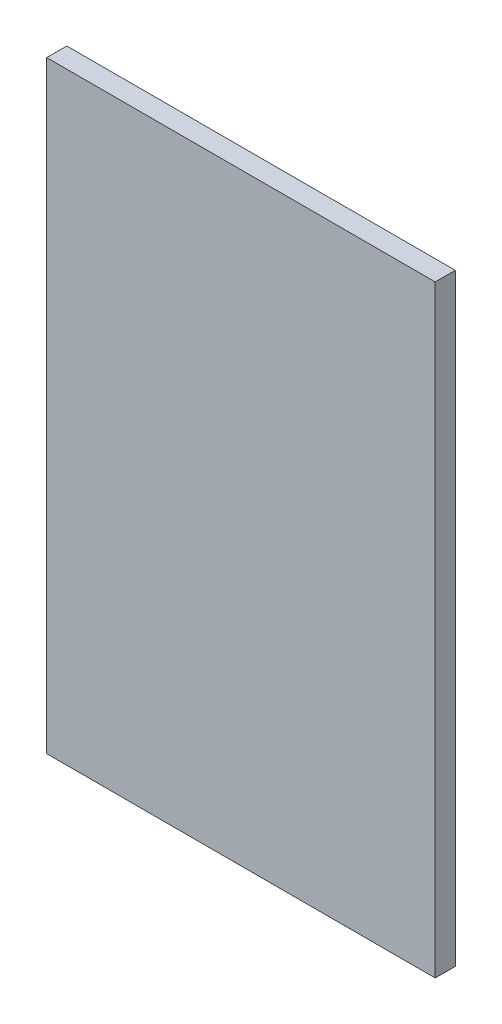
ISO-10303-21;
HEADER;
FILE_DESCRIPTION(('STEP AP214'),'2;1');
FILE_NAME('part.step','',(''),(''),'','','');
FILE_SCHEMA(('AUTOMOTIVE_DESIGN { 1 0 10303 214 1 1 1 1 }'));
ENDSEC;
DATA;
#1=APPLICATION_CONTEXT('core data for automotive mechanical design processes');
#2=APPLICATION_PROTOCOL_DEFINITION('international standard','automotive_design',2000,#1);
#3=PRODUCT_CONTEXT('',#1,'mechanical');
#4=PRODUCT('Part','Part','',(#3));
#5=PRODUCT_RELATED_PRODUCT_CATEGORY('part','',(#4));
#6=PRODUCT_DEFINITION_FORMATION('','',#4);
#7=PRODUCT_DEFINITION_CONTEXT('part definition',#1,'design');
#8=PRODUCT_DEFINITION('design','',#6,#7);
#9=PRODUCT_DEFINITION_SHAPE('','',#8);
#10=(LENGTH_UNIT() NAMED_UNIT(*) SI_UNIT(.MILLI.,.METRE.));
#11=(NAMED_UNIT(*) PLANE_ANGLE_UNIT() SI_UNIT($,.RADIAN.));
#12=(NAMED_UNIT(*) SI_UNIT($,.STERADIAN.) SOLID_ANGLE_UNIT());
#13=UNCERTAINTY_MEASURE_WITH_UNIT(LENGTH_MEASURE(1.E-05),#10,'distance_accuracy_value','');
#14=(GEOMETRIC_REPRESENTATION_CONTEXT(3) GLOBAL_UNCERTAINTY_ASSIGNED_CONTEXT((#13)) GLOBAL_UNIT_ASSIGNED_CONTEXT((#10,
#11,#12)) REPRESENTATION_CONTEXT('',''));
#15=CARTESIAN_POINT('',(0.,0.,0.));
#16=DIRECTION('',(0.,0.,1.));
#17=DIRECTION('',(1.,0.,0.));
#18=AXIS2_PLACEMENT_3D('',#15,#16,#17);
#19=CARTESIAN_POINT('',(0.,0.,3.));
#20=DIRECTION('',(1.,0.,0.));
#21=DIRECTION('',(0.,1.,0.));
#22=AXIS2_PLACEMENT_3D('',#19,#20,#21);
#23=PLANE('',#22);
#24=DIRECTION('',(0.,-1.,0.));
#25=VECTOR('',#24,1.);
#26=CARTESIAN_POINT('',(0.,0.,0.));
#27=LINE('',#26,#25);
#28=CARTESIAN_POINT('',(0.,0.,0.));
#29=VERTEX_POINT('',#28);
#30=CARTESIAN_POINT('',(0.,-90.,0.));
#31=VERTEX_POINT('',#30);
#32=EDGE_CURVE('E96',#29,#31,#27,.T.);
#33=ORIENTED_EDGE('',*,*,#32,.T.);
#34=DIRECTION('',(0.,0.,-1.));
#35=VECTOR('',#34,1.);
#36=CARTESIAN_POINT('',(0.,-90.,3.));
#37=LINE('',#36,#35);
#38=CARTESIAN_POINT('',(0.,-90.,3.));
#39=VERTEX_POINT('',#38);
#40=EDGE_CURVE('E11',#39,#31,#37,.T.);
#41=ORIENTED_EDGE('',*,*,#40,.F.);
#42=DIRECTION('',(0.,-1.,0.));
#43=VECTOR('',#42,1.);
#44=CARTESIAN_POINT('',(0.,0.,3.));
#45=LINE('',#44,#43);
#46=CARTESIAN_POINT('',(0.,0.,3.));
#47=VERTEX_POINT('',#46);
#48=EDGE_CURVE('E84',#47,#39,#45,.T.);
#49=ORIENTED_EDGE('',*,*,#48,.F.);
#50=DIRECTION('',(0.,0.,-1.));
#51=VECTOR('',#50,1.);
#52=CARTESIAN_POINT('',(0.,0.,3.));
#53=LINE('',#52,#51);
#54=EDGE_CURVE('E92',#47,#29,#53,.T.);
#55=ORIENTED_EDGE('',*,*,#54,.T.);
#56=EDGE_LOOP('',(#33,#41,#49,#55));
#57=FACE_BOUND('',#56,.T.);
#58=ADVANCED_FACE('F33',(#57),#23,.F.);
#59=CARTESIAN_POINT('',(0.,-90.,3.));
#60=DIRECTION('',(0.,1.,0.));
#61=DIRECTION('',(0.,0.,1.));
#62=AXIS2_PLACEMENT_3D('',#59,#60,#61);
#63=PLANE('',#62);
#64=DIRECTION('',(1.,0.,0.));
#65=VECTOR('',#64,1.);
#66=CARTESIAN_POINT('',(0.,-90.,0.));
#67=LINE('',#66,#65);
#68=CARTESIAN_POINT('',(58.,-90.,0.));
#69=VERTEX_POINT('',#68);
#70=EDGE_CURVE('E88',#31,#69,#67,.T.);
#71=ORIENTED_EDGE('',*,*,#70,.T.);
#72=DIRECTION('',(0.,0.,-1.));
#73=VECTOR('',#72,1.);
#74=CARTESIAN_POINT('',(58.,-90.,3.));
#75=LINE('',#74,#73);
#76=CARTESIAN_POINT('',(58.,-90.,3.));
#77=VERTEX_POINT('',#76);
#78=EDGE_CURVE('E41',#77,#69,#75,.T.);
#79=ORIENTED_EDGE('',*,*,#78,.F.);
#80=DIRECTION('',(1.,0.,0.));
#81=VECTOR('',#80,1.);
#82=CARTESIAN_POINT('',(0.,-90.,3.));
#83=LINE('',#82,#81);
#84=EDGE_CURVE('E79',#39,#77,#83,.T.);
#85=ORIENTED_EDGE('',*,*,#84,.F.);
#86=ORIENTED_EDGE('',*,*,#40,.T.);
#87=EDGE_LOOP('',(#71,#79,#85,#86));
#88=FACE_BOUND('',#87,.T.);
#89=ADVANCED_FACE('F87',(#88),#63,.F.);
#90=CARTESIAN_POINT('',(58.,0.,3.));
#91=DIRECTION('',(-1.,0.,0.));
#92=DIRECTION('',(0.,-1.,0.));
#93=AXIS2_PLACEMENT_3D('',#90,#91,#92);
#94=PLANE('',#93);
#95=DIRECTION('',(0.,1.,0.));
#96=VECTOR('',#95,1.);
#97=CARTESIAN_POINT('',(58.,0.,0.));
#98=LINE('',#97,#96);
#99=CARTESIAN_POINT('',(58.,0.,0.));
#100=VERTEX_POINT('',#99);
#101=EDGE_CURVE('E66',#69,#100,#98,.T.);
#102=ORIENTED_EDGE('',*,*,#101,.T.);
#103=DIRECTION('',(0.,0.,-1.));
#104=VECTOR('',#103,1.);
#105=CARTESIAN_POINT('',(58.,0.,3.));
#106=LINE('',#105,#104);
#107=CARTESIAN_POINT('',(58.,0.,3.));
#108=VERTEX_POINT('',#107);
#109=EDGE_CURVE('E89',#108,#100,#106,.T.);
#110=ORIENTED_EDGE('',*,*,#109,.F.);
#111=DIRECTION('',(0.,1.,0.));
#112=VECTOR('',#111,1.);
#113=CARTESIAN_POINT('',(58.,0.,3.));
#114=LINE('',#113,#112);
#115=EDGE_CURVE('E82',#77,#108,#114,.T.);
#116=ORIENTED_EDGE('',*,*,#115,.F.);
#117=ORIENTED_EDGE('',*,*,#78,.T.);
#118=EDGE_LOOP('',(#102,#110,#116,#117));
#119=FACE_BOUND('',#118,.T.);
#120=ADVANCED_FACE('F90',(#119),#94,.F.);
#121=CARTESIAN_POINT('',(0.,0.,3.));
#122=DIRECTION('',(0.,-1.,0.));
#123=DIRECTION('',(0.,0.,-1.));
#124=AXIS2_PLACEMENT_3D('',#121,#122,#123);
#125=PLANE('',#124);
#126=DIRECTION('',(-1.,0.,0.));
#127=VECTOR('',#126,1.);
#128=CARTESIAN_POINT('',(0.,0.,0.));
#129=LINE('',#128,#127);
#130=EDGE_CURVE('E72',#100,#29,#129,.T.);
#131=ORIENTED_EDGE('',*,*,#130,.T.);
#132=ORIENTED_EDGE('',*,*,#54,.F.);
#133=DIRECTION('',(-1.,0.,0.));
#134=VECTOR('',#133,1.);
#135=CARTESIAN_POINT('',(0.,0.,3.));
#136=LINE('',#135,#134);
#137=EDGE_CURVE('E49',#108,#47,#136,.T.);
#138=ORIENTED_EDGE('',*,*,#137,.F.);
#139=ORIENTED_EDGE('',*,*,#109,.T.);
#140=EDGE_LOOP('',(#131,#132,#138,#139));
#141=FACE_BOUND('',#140,.T.);
#142=ADVANCED_FACE('F103',(#141),#125,.F.);
#143=CARTESIAN_POINT('',(0.,0.,3.));
#144=DIRECTION('',(0.,0.,1.));
#145=DIRECTION('',(1.,0.,0.));
#146=AXIS2_PLACEMENT_3D('',#143,#144,#145);
#147=PLANE('',#146);
#148=ORIENTED_EDGE('',*,*,#48,.T.);
#149=ORIENTED_EDGE('',*,*,#84,.T.);
#150=ORIENTED_EDGE('',*,*,#115,.T.);
#151=ORIENTED_EDGE('',*,*,#137,.T.);
#152=EDGE_LOOP('',(#148,#149,#150,#151));
#153=FACE_BOUND('',#152,.T.);
#154=ADVANCED_FACE('F80',(#153),#147,.T.);
#155=CARTESIAN_POINT('',(0.,0.,0.));
#156=DIRECTION('',(0.,0.,1.));
#157=DIRECTION('',(1.,0.,0.));
#158=AXIS2_PLACEMENT_3D('',#155,#156,#157);
#159=PLANE('',#158);
#160=ORIENTED_EDGE('',*,*,#32,.F.);
#161=ORIENTED_EDGE('',*,*,#130,.F.);
#162=ORIENTED_EDGE('',*,*,#101,.F.);
#163=ORIENTED_EDGE('',*,*,#70,.F.);
#164=EDGE_LOOP('',(#160,#161,#162,#163));
#165=FACE_BOUND('',#164,.T.);
#166=ADVANCED_FACE('F106',(#165),#159,.F.);
#167=CLOSED_SHELL('',(#58,#89,#120,#142,#154,#166));
#168=MANIFOLD_SOLID_BREP('B2',#167);
#169=ADVANCED_BREP_SHAPE_REPRESENTATION('',(#18,#168),#14);
#170=SHAPE_DEFINITION_REPRESENTATION(#9,#169);
ENDSEC;
END-ISO-10303-21;
